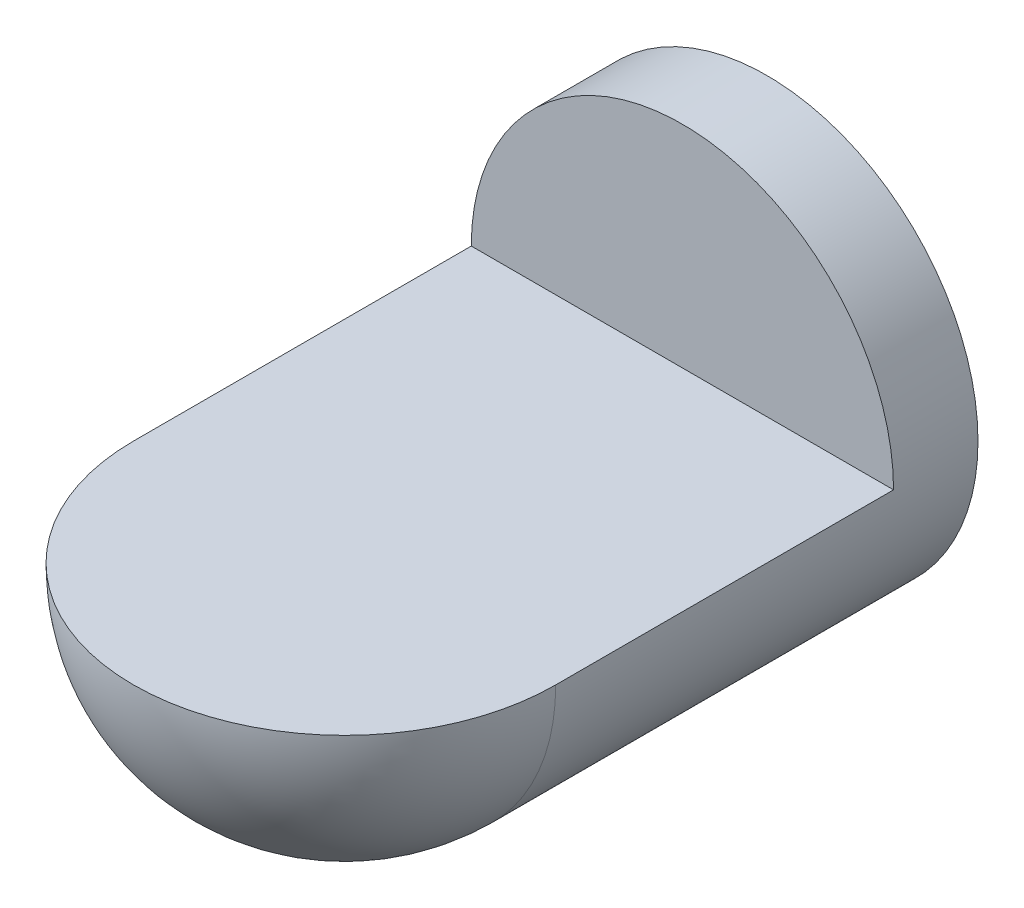
ISO-10303-21;
HEADER;
FILE_DESCRIPTION(('STEP AP214'),'2;1');
FILE_NAME('part.step','',(''),(''),'','','');
FILE_SCHEMA(('AUTOMOTIVE_DESIGN { 1 0 10303 214 1 1 1 1 }'));
ENDSEC;
DATA;
#1=APPLICATION_CONTEXT('core data for automotive mechanical design processes');
#2=APPLICATION_PROTOCOL_DEFINITION('international standard','automotive_design',2000,#1);
#3=PRODUCT_CONTEXT('',#1,'mechanical');
#4=PRODUCT('Part','Part','',(#3));
#5=PRODUCT_RELATED_PRODUCT_CATEGORY('part','',(#4));
#6=PRODUCT_DEFINITION_FORMATION('','',#4);
#7=PRODUCT_DEFINITION_CONTEXT('part definition',#1,'design');
#8=PRODUCT_DEFINITION('design','',#6,#7);
#9=PRODUCT_DEFINITION_SHAPE('','',#8);
#10=(LENGTH_UNIT() NAMED_UNIT(*) SI_UNIT(.MILLI.,.METRE.));
#11=(NAMED_UNIT(*) PLANE_ANGLE_UNIT() SI_UNIT($,.RADIAN.));
#12=(NAMED_UNIT(*) SI_UNIT($,.STERADIAN.) SOLID_ANGLE_UNIT());
#13=UNCERTAINTY_MEASURE_WITH_UNIT(LENGTH_MEASURE(1.E-05),#10,'distance_accuracy_value','');
#14=(GEOMETRIC_REPRESENTATION_CONTEXT(3) GLOBAL_UNCERTAINTY_ASSIGNED_CONTEXT((#13)) GLOBAL_UNIT_ASSIGNED_CONTEXT((#10,
#11,#12)) REPRESENTATION_CONTEXT('',''));
#15=CARTESIAN_POINT('',(0.,0.,0.));
#16=DIRECTION('',(0.,0.,1.));
#17=DIRECTION('',(1.,0.,0.));
#18=AXIS2_PLACEMENT_3D('',#15,#16,#17);
#19=CARTESIAN_POINT('',(0.,0.,0.));
#20=DIRECTION('',(0.,0.,1.));
#21=DIRECTION('',(0.,1.,0.));
#22=AXIS2_PLACEMENT_3D('',#19,#20,#21);
#23=SPHERICAL_SURFACE('',#22,75.);
#24=CARTESIAN_POINT('',(0.,0.,0.));
#25=DIRECTION('',(0.,1.,0.));
#26=DIRECTION('',(0.,0.,1.));
#27=AXIS2_PLACEMENT_3D('',#24,#25,#26);
#28=CIRCLE('',#27,75.);
#29=CARTESIAN_POINT('',(-75.,0.,0.));
#30=VERTEX_POINT('',#29);
#31=CARTESIAN_POINT('',(75.,0.,0.));
#32=VERTEX_POINT('',#31);
#33=EDGE_CURVE('E52',#30,#32,#28,.T.);
#34=ORIENTED_EDGE('',*,*,#33,.F.);
#35=CARTESIAN_POINT('',(0.,0.,0.));
#36=DIRECTION('',(0.,0.,1.));
#37=DIRECTION('',(1.,0.,0.));
#38=AXIS2_PLACEMENT_3D('',#35,#36,#37);
#39=CIRCLE('',#38,75.);
#40=EDGE_CURVE('E73',#30,#32,#39,.T.);
#41=ORIENTED_EDGE('',*,*,#40,.T.);
#42=EDGE_LOOP('',(#34,#41));
#43=FACE_BOUND('',#42,.T.);
#44=ADVANCED_FACE('F33',(#43),#23,.T.);
#45=CARTESIAN_POINT('',(0.,0.,146.909145290857));
#46=DIRECTION('',(0.,0.,1.));
#47=DIRECTION('',(1.,0.,0.));
#48=AXIS2_PLACEMENT_3D('',#45,#46,#47);
#49=CYLINDRICAL_SURFACE('',#48,75.);
#50=CARTESIAN_POINT('',(0.,0.,-150.));
#51=DIRECTION('',(0.,0.,1.));
#52=DIRECTION('',(1.,0.,0.));
#53=AXIS2_PLACEMENT_3D('',#50,#51,#52);
#54=CIRCLE('',#53,75.);
#55=CARTESIAN_POINT('',(75.,0.,-150.));
#56=VERTEX_POINT('',#55);
#57=EDGE_CURVE('E68',#56,#56,#54,.T.);
#58=ORIENTED_EDGE('',*,*,#57,.T.);
#59=EDGE_LOOP('',(#58));
#60=FACE_BOUND('',#59,.T.);
#61=DIRECTION('',(0.,0.,1.));
#62=VECTOR('',#61,1.);
#63=CARTESIAN_POINT('',(75.,0.,146.909145290857));
#64=LINE('',#63,#62);
#65=CARTESIAN_POINT('',(75.,0.,-120.));
#66=VERTEX_POINT('',#65);
#67=EDGE_CURVE('E11',#32,#66,#64,.F.);
#68=ORIENTED_EDGE('',*,*,#67,.F.);
#69=ORIENTED_EDGE('',*,*,#40,.F.);
#70=DIRECTION('',(0.,0.,1.));
#71=VECTOR('',#70,1.);
#72=CARTESIAN_POINT('',(-75.,0.,146.909145290857));
#73=LINE('',#72,#71);
#74=CARTESIAN_POINT('',(-75.,0.,-120.));
#75=VERTEX_POINT('',#74);
#76=EDGE_CURVE('E63',#75,#30,#73,.T.);
#77=ORIENTED_EDGE('',*,*,#76,.F.);
#78=CARTESIAN_POINT('',(0.,0.,-120.));
#79=DIRECTION('',(0.,0.,1.));
#80=DIRECTION('',(1.,0.,0.));
#81=AXIS2_PLACEMENT_3D('',#78,#79,#80);
#82=CIRCLE('',#81,75.);
#83=EDGE_CURVE('E41',#66,#75,#82,.T.);
#84=ORIENTED_EDGE('',*,*,#83,.F.);
#85=EDGE_LOOP('',(#68,#69,#77,#84));
#86=FACE_BOUND('',#85,.T.);
#87=ADVANCED_FACE('F60',(#60,#86),#49,.T.);
#88=CARTESIAN_POINT('',(0.,0.,-150.));
#89=DIRECTION('',(0.,0.,1.));
#90=DIRECTION('',(1.,0.,0.));
#91=AXIS2_PLACEMENT_3D('',#88,#89,#90);
#92=PLANE('',#91);
#93=ORIENTED_EDGE('',*,*,#57,.F.);
#94=EDGE_LOOP('',(#93));
#95=FACE_BOUND('',#94,.T.);
#96=ADVANCED_FACE('F35',(#95),#92,.F.);
#97=CARTESIAN_POINT('',(75.,0.,-120.));
#98=DIRECTION('',(0.,1.,0.));
#99=DIRECTION('',(0.,0.,1.));
#100=AXIS2_PLACEMENT_3D('',#97,#98,#99);
#101=PLANE('',#100);
#102=ORIENTED_EDGE('',*,*,#33,.T.);
#103=ORIENTED_EDGE('',*,*,#67,.T.);
#104=DIRECTION('',(-1.,0.,0.));
#105=VECTOR('',#104,1.);
#106=CARTESIAN_POINT('',(75.,0.,-120.));
#107=LINE('',#106,#105);
#108=EDGE_CURVE('E47',#66,#75,#107,.T.);
#109=ORIENTED_EDGE('',*,*,#108,.T.);
#110=ORIENTED_EDGE('',*,*,#76,.T.);
#111=EDGE_LOOP('',(#102,#103,#109,#110));
#112=FACE_BOUND('',#111,.T.);
#113=ADVANCED_FACE('F65',(#112),#101,.T.);
#114=CARTESIAN_POINT('',(75.,0.,-120.));
#115=DIRECTION('',(0.,0.,1.));
#116=DIRECTION('',(1.,0.,0.));
#117=AXIS2_PLACEMENT_3D('',#114,#115,#116);
#118=PLANE('',#117);
#119=ORIENTED_EDGE('',*,*,#108,.F.);
#120=ORIENTED_EDGE('',*,*,#83,.T.);
#121=EDGE_LOOP('',(#119,#120));
#122=FACE_BOUND('',#121,.T.);
#123=ADVANCED_FACE('F66',(#122),#118,.T.);
#124=CLOSED_SHELL('',(#44,#87,#96,#113,#123));
#125=MANIFOLD_SOLID_BREP('B2',#124);
#126=ADVANCED_BREP_SHAPE_REPRESENTATION('',(#18,#125),#14);
#127=SHAPE_DEFINITION_REPRESENTATION(#9,#126);
ENDSEC;
END-ISO-10303-21;
